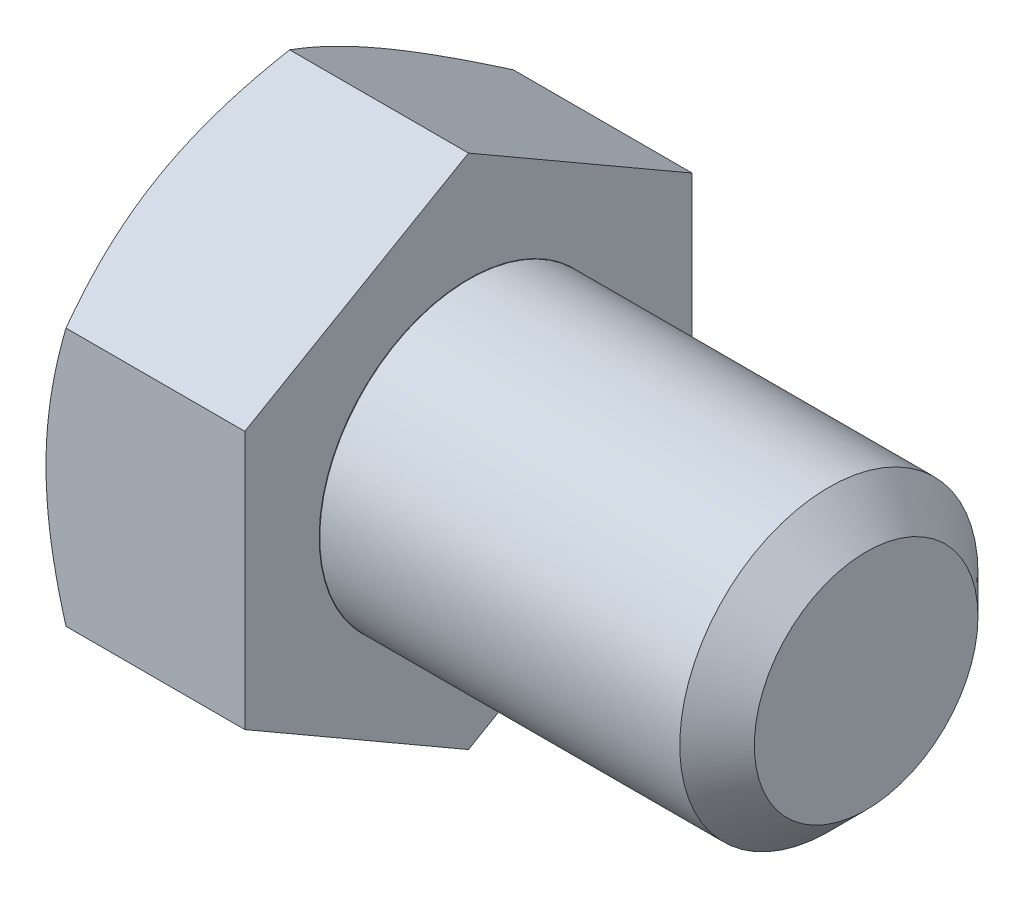
ISO-10303-21;
HEADER;
FILE_DESCRIPTION(('STEP AP214'),'2;1');
FILE_NAME('part.step','',(''),(''),'','','');
FILE_SCHEMA(('AUTOMOTIVE_DESIGN { 1 0 10303 214 1 1 1 1 }'));
ENDSEC;
DATA;
#1=APPLICATION_CONTEXT('core data for automotive mechanical design processes');
#2=APPLICATION_PROTOCOL_DEFINITION('international standard','automotive_design',2000,#1);
#3=PRODUCT_CONTEXT('',#1,'mechanical');
#4=PRODUCT('Part','Part','',(#3));
#5=PRODUCT_RELATED_PRODUCT_CATEGORY('part','',(#4));
#6=PRODUCT_DEFINITION_FORMATION('','',#4);
#7=PRODUCT_DEFINITION_CONTEXT('part definition',#1,'design');
#8=PRODUCT_DEFINITION('design','',#6,#7);
#9=PRODUCT_DEFINITION_SHAPE('','',#8);
#10=(LENGTH_UNIT() NAMED_UNIT(*) SI_UNIT(.MILLI.,.METRE.));
#11=(NAMED_UNIT(*) PLANE_ANGLE_UNIT() SI_UNIT($,.RADIAN.));
#12=(NAMED_UNIT(*) SI_UNIT($,.STERADIAN.) SOLID_ANGLE_UNIT());
#13=UNCERTAINTY_MEASURE_WITH_UNIT(LENGTH_MEASURE(1.E-05),#10,'distance_accuracy_value','');
#14=(GEOMETRIC_REPRESENTATION_CONTEXT(3) GLOBAL_UNCERTAINTY_ASSIGNED_CONTEXT((#13)) GLOBAL_UNIT_ASSIGNED_CONTEXT((#10,
#11,#12)) REPRESENTATION_CONTEXT('',''));
#15=CARTESIAN_POINT('',(0.,0.,0.));
#16=DIRECTION('',(0.,0.,1.));
#17=DIRECTION('',(1.,0.,0.));
#18=AXIS2_PLACEMENT_3D('',#15,#16,#17);
#19=CARTESIAN_POINT('',(-3.17499999999998,0.,0.));
#20=DIRECTION('',(1.,0.,0.));
#21=DIRECTION('',(0.,0.,-1.));
#22=AXIS2_PLACEMENT_3D('',#19,#20,#21);
#23=CYLINDRICAL_SURFACE('',#22,4.7625);
#24=CARTESIAN_POINT('',(8.334375,0.,0.));
#25=DIRECTION('',(1.,0.,0.));
#26=DIRECTION('',(0.,0.,-1.));
#27=AXIS2_PLACEMENT_3D('',#24,#25,#26);
#28=CIRCLE('',#27,4.7625);
#29=CARTESIAN_POINT('',(8.334375,0.,-4.7625));
#30=VERTEX_POINT('',#29);
#31=EDGE_CURVE('E12',#30,#30,#28,.F.);
#32=ORIENTED_EDGE('',*,*,#31,.T.);
#33=EDGE_LOOP('',(#32));
#34=FACE_BOUND('',#33,.T.);
#35=CARTESIAN_POINT('',(-3.16422144782449,0.,0.));
#36=DIRECTION('',(-1.,0.,0.));
#37=DIRECTION('',(0.,-1.,0.));
#38=AXIS2_PLACEMENT_3D('',#35,#36,#37);
#39=CIRCLE('',#38,4.7625);
#40=CARTESIAN_POINT('',(-3.16422144782449,-4.7625,0.));
#41=VERTEX_POINT('',#40);
#42=EDGE_CURVE('E41',#41,#41,#39,.F.);
#43=ORIENTED_EDGE('',*,*,#42,.T.);
#44=EDGE_LOOP('',(#43));
#45=FACE_BOUND('',#44,.T.);
#46=ADVANCED_FACE('F37',(#34,#45),#23,.T.);
#47=CARTESIAN_POINT('',(9.52500000000001,0.,0.));
#48=DIRECTION('',(1.,0.,0.));
#49=DIRECTION('',(0.,0.,-1.));
#50=AXIS2_PLACEMENT_3D('',#47,#48,#49);
#51=PLANE('',#50);
#52=CARTESIAN_POINT('',(9.52500000000001,0.,0.));
#53=DIRECTION('',(1.,0.,0.));
#54=DIRECTION('',(0.,0.,-1.));
#55=AXIS2_PLACEMENT_3D('',#52,#53,#54);
#56=CIRCLE('',#55,3.571875);
#57=CARTESIAN_POINT('',(9.52500000000001,0.,-3.571875));
#58=VERTEX_POINT('',#57);
#59=EDGE_CURVE('E46',#58,#58,#56,.T.);
#60=ORIENTED_EDGE('',*,*,#59,.T.);
#61=EDGE_LOOP('',(#60));
#62=FACE_BOUND('',#61,.T.);
#63=ADVANCED_FACE('F210',(#62),#51,.T.);
#64=CARTESIAN_POINT('',(9.52500000000001,0.,0.));
#65=DIRECTION('',(-1.,0.,0.));
#66=DIRECTION('',(0.,0.,1.));
#67=AXIS2_PLACEMENT_3D('',#64,#65,#66);
#68=CONICAL_SURFACE('',#67,3.571875,0.785398163397447);
#69=ORIENTED_EDGE('',*,*,#31,.F.);
#70=EDGE_LOOP('',(#69));
#71=FACE_BOUND('',#70,.T.);
#72=ORIENTED_EDGE('',*,*,#59,.F.);
#73=EDGE_LOOP('',(#72));
#74=FACE_BOUND('',#73,.T.);
#75=ADVANCED_FACE('F39',(#71,#74),#68,.T.);
#76=CARTESIAN_POINT('',(5.08467052322226,0.,0.));
#77=DIRECTION('',(-1.,0.,0.));
#78=DIRECTION('',(0.,-1.,0.));
#79=AXIS2_PLACEMENT_3D('',#76,#77,#78);
#80=CONICAL_SURFACE('',#79,0.,0.5235987755983);
#81=ORIENTED_EDGE('',*,*,#42,.F.);
#82=EDGE_LOOP('',(#81));
#83=FACE_BOUND('',#82,.T.);
#84=CARTESIAN_POINT('',(-3.17499999999998,0.,0.));
#85=DIRECTION('',(-1.,0.,0.));
#86=DIRECTION('',(0.,-1.,0.));
#87=AXIS2_PLACEMENT_3D('',#84,#85,#86);
#88=CIRCLE('',#87,4.768723);
#89=CARTESIAN_POINT('',(-3.17499999999998,-4.768723,0.));
#90=VERTEX_POINT('',#89);
#91=EDGE_CURVE('E128',#90,#90,#88,.T.);
#92=ORIENTED_EDGE('',*,*,#91,.F.);
#93=EDGE_LOOP('',(#92));
#94=FACE_BOUND('',#93,.T.);
#95=ADVANCED_FACE('F219',(#83,#94),#80,.T.);
#96=CARTESIAN_POINT('',(-9.52500000000001,-4.12444598552339,7.14375));
#97=DIRECTION('',(0.,0.,-1.));
#98=DIRECTION('',(0.,1.,0.));
#99=AXIS2_PLACEMENT_3D('',#96,#97,#98);
#100=PLANE('',#99);
#101=CARTESIAN_POINT('',(-5.93371072912466,-11.2944476437763,7.14375));
#102=CARTESIAN_POINT('',(-6.08684701816095,-10.9805232394077,7.14375000000001));
#103=CARTESIAN_POINT('',(-6.23857594161992,-10.6659008872169,7.14375000000001));
#104=CARTESIAN_POINT('',(-6.53843148642025,-10.0348898213436,7.14375000000001));
#105=CARTESIAN_POINT('',(-6.68655757920349,-9.71850085675994,7.14375000000001));
#106=CARTESIAN_POINT('',(-6.97911945790795,-9.08205743380555,7.14375000000001));
#107=CARTESIAN_POINT('',(-7.1235325502159,-8.76199250898871,7.14375000000001));
#108=CARTESIAN_POINT('',(-7.40672905657404,-8.1193909617974,7.14375000000001));
#109=CARTESIAN_POINT('',(-7.54551272309654,-7.79685445104334,7.14375000000001));
#110=CARTESIAN_POINT('',(-7.82061626761982,-7.13766604016633,7.14375000000001));
#111=CARTESIAN_POINT('',(-7.95668768509606,-6.80090989506933,7.14375000000001));
#112=CARTESIAN_POINT('',(-8.21904465695922,-6.12353919008608,7.14375000000001));
#113=CARTESIAN_POINT('',(-8.34532914408246,-5.78292421402389,7.14375));
#114=CARTESIAN_POINT('',(-8.58495433052842,-5.09786024749812,7.14375));
#115=CARTESIAN_POINT('',(-8.69831945636304,-4.75341989048741,7.14375));
#116=CARTESIAN_POINT('',(-8.90861291619239,-4.05961513378648,7.14375));
#117=CARTESIAN_POINT('',(-9.00554620334679,-3.71025225244226,7.14375));
#118=CARTESIAN_POINT('',(-9.17794726569409,-3.00829070513183,7.14375));
#119=CARTESIAN_POINT('',(-9.25353684099416,-2.65572276057783,7.14375));
#120=CARTESIAN_POINT('',(-9.34774730173221,-2.12349462014205,7.14375));
#121=CARTESIAN_POINT('',(-9.37595632988756,-1.94551103747566,7.14375));
#122=CARTESIAN_POINT('',(-9.42543567209938,-1.58858869612631,7.14375));
#123=CARTESIAN_POINT('',(-9.44670669479306,-1.40965003689206,7.14375));
#124=CARTESIAN_POINT('',(-9.48160791676572,-1.05348730697548,7.14375));
#125=CARTESIAN_POINT('',(-9.49533827490667,-0.876273093939472,7.14375));
#126=CARTESIAN_POINT('',(-9.51528471556112,-0.52142209223077,7.14375));
#127=CARTESIAN_POINT('',(-9.52150092898989,-0.343785310974307,7.14375));
#128=CARTESIAN_POINT('',(-9.5262697532719,0.0115936241285987,7.14375));
#129=CARTESIAN_POINT('',(-9.52482233137117,0.189335778422154,7.14375));
#130=CARTESIAN_POINT('',(-9.51430143505044,0.544596189800658,7.14375));
#131=CARTESIAN_POINT('',(-9.50522762080285,0.722114436555397,7.14375));
#132=CARTESIAN_POINT('',(-9.4749195257372,1.14231672690702,7.14375));
#133=CARTESIAN_POINT('',(-9.45042490108959,1.38477115845962,7.14375));
#134=CARTESIAN_POINT('',(-9.3884979515929,1.86800860977946,7.14375));
#135=CARTESIAN_POINT('',(-9.3510640485552,2.10879142200519,7.14375));
#136=CARTESIAN_POINT('',(-9.22132806473631,2.82827840353934,7.14375));
#137=CARTESIAN_POINT('',(-9.11161060877735,3.30389106689052,7.14375));
#138=CARTESIAN_POINT('',(-8.91968369997709,4.01550298491581,7.14375));
#139=CARTESIAN_POINT('',(-8.85018765803782,4.2551445486297,7.14375));
#140=CARTESIAN_POINT('',(-8.70356361255966,4.73210450573967,7.14375));
#141=CARTESIAN_POINT('',(-8.62643554863459,4.96942288073787,7.14375));
#142=CARTESIAN_POINT('',(-8.46581893944217,5.4418061469649,7.14375));
#143=CARTESIAN_POINT('',(-8.38233210608425,5.67687162566703,7.14375));
#144=CARTESIAN_POINT('',(-8.21002141112747,6.14502503891484,7.14375));
#145=CARTESIAN_POINT('',(-8.12119768188874,6.37811302234081,7.14375));
#146=CARTESIAN_POINT('',(-7.87094818930498,7.01633974983141,7.14375));
#147=CARTESIAN_POINT('',(-7.70494014176838,7.41968025406995,7.14375));
#148=CARTESIAN_POINT('',(-7.36287467668176,8.22209357946086,7.14375));
#149=CARTESIAN_POINT('',(-7.18681604954135,8.62116588004215,7.14375));
#150=CARTESIAN_POINT('',(-6.82707563050151,9.41604681837601,7.14375));
#151=CARTESIAN_POINT('',(-6.64339071307001,9.81185403670851,7.14375));
#152=CARTESIAN_POINT('',(-6.27025973065678,10.600712317216,7.14375));
#153=CARTESIAN_POINT('',(-6.08081392218425,10.9937635011499,7.14375));
#154=CARTESIAN_POINT('',(-5.6971131080566,11.7783335003943,7.14375));
#155=CARTESIAN_POINT('',(-5.50285048567349,12.1698485826142,7.14375));
#156=CARTESIAN_POINT('',(-5.11077276765251,12.9510972653694,7.14375));
#157=CARTESIAN_POINT('',(-4.91295763958178,13.3408308495995,7.14375));
#158=CARTESIAN_POINT('',(-4.51453178773117,14.1187472681695,7.14375));
#159=CARTESIAN_POINT('',(-4.31392174218005,14.5069304503015,7.14375));
#160=CARTESIAN_POINT('',(-3.91039131968376,15.2820948012496,7.14375));
#161=CARTESIAN_POINT('',(-3.70747093338289,15.6690759651901,7.14375));
#162=CARTESIAN_POINT('',(-3.14034733034596,16.7442233759679,7.14375));
#163=CARTESIAN_POINT('',(-2.77409176308878,17.4313067825052,7.14375));
#164=CARTESIAN_POINT('',(-2.03723567347499,18.8031936251545,7.14375));
#165=CARTESIAN_POINT('',(-1.66663486270932,19.4879969060088,7.14375));
#166=CARTESIAN_POINT('',(-0.92352014301375,20.8534506388627,7.14375));
#167=CARTESIAN_POINT('',(-0.551017506612391,21.5341072316457,7.14375));
#168=CARTESIAN_POINT('',(0.196444878969431,22.8939962458748,7.14374999999999));
#169=CARTESIAN_POINT('',(0.571404419683328,23.5732287818577,7.14374999999999));
#170=CARTESIAN_POINT('',(0.947254101476003,24.2519647910624,7.14374999999999));
#171=B_SPLINE_CURVE_WITH_KNOTS('',3,(#101,#102,#103,#104,#105,#106,#107,#108,#109,#110,#111,
#112,#113,#114,#115,#116,#117,#118,#119,#120,#121,#122,#123,#124,#125,#126,#127,#128,#129,#130,
#131,#132,#133,#134,#135,#136,#137,#138,#139,#140,#141,#142,#143,#144,#145,#146,#147,#148,#149,
#150,#151,#152,#153,#154,#155,#156,#157,#158,#159,#160,#161,#162,#163,#164,#165,#166,#167,#168,
#169,#170),.UNSPECIFIED.,.F.,.F.,(4,2,2,2,2,2,2,2,2,2,2,2,2,2,2,2,2,2,2,2,2,2,2,2,2,2,2,2,2,2,2,
2,2,2,4),(0.,1.04786354483491,2.0958799018221,3.14924522983534,4.20256326345294,5.2920693919564,
6.38169416429138,7.46922336086985,8.55642415101154,9.63728918942531,10.1777908946976,
10.7182373766564,11.2513201674657,11.7843936705003,12.3174694518642,12.8505689880335,
13.5812265935341,14.3119733479507,15.7741561909275,16.522632821703,17.2711153750576,
18.0193971292228,18.7676603329377,20.0759569450815,21.384411344443,22.6934073945101,
24.002345245369,25.3135047056319,26.6246761423151,27.9355347616116,29.2463986911018,
31.5821913644605,33.9181399602315,36.2458936638359,38.573452352829),.UNSPECIFIED.);
#172=CARTESIAN_POINT('',(-8.88694598552339,-4.12444598552339,7.14375));
#173=VERTEX_POINT('',#172);
#174=CARTESIAN_POINT('',(-9.52500000000001,0.,7.14375));
#175=VERTEX_POINT('',#174);
#176=EDGE_CURVE('E228',#173,#175,#171,.T.);
#177=ORIENTED_EDGE('',*,*,#176,.F.);
#178=DIRECTION('',(1.,0.,0.));
#179=VECTOR('',#178,1.);
#180=CARTESIAN_POINT('',(-9.52500000000001,-4.12444598552339,7.14375));
#181=LINE('',#180,#179);
#182=CARTESIAN_POINT('',(-3.17499999999998,-4.12444598552339,7.14375));
#183=VERTEX_POINT('',#182);
#184=EDGE_CURVE('E231',#173,#183,#181,.T.);
#185=ORIENTED_EDGE('',*,*,#184,.T.);
#186=DIRECTION('',(0.,1.,0.));
#187=VECTOR('',#186,1.);
#188=CARTESIAN_POINT('',(-3.17499999999998,-4.12444598552339,7.14375));
#189=LINE('',#188,#187);
#190=CARTESIAN_POINT('',(-3.17499999999998,4.12444598552339,7.14375));
#191=VERTEX_POINT('',#190);
#192=EDGE_CURVE('E233',#183,#191,#189,.T.);
#193=ORIENTED_EDGE('',*,*,#192,.T.);
#194=DIRECTION('',(1.,0.,0.));
#195=VECTOR('',#194,1.);
#196=CARTESIAN_POINT('',(-9.52500000000001,4.12444598552339,7.14375));
#197=LINE('',#196,#195);
#198=CARTESIAN_POINT('',(-8.88694598552339,4.12444598552339,7.14375));
#199=VERTEX_POINT('',#198);
#200=EDGE_CURVE('E253',#199,#191,#197,.T.);
#201=ORIENTED_EDGE('',*,*,#200,.F.);
#202=EDGE_CURVE('E113',#175,#199,#171,.T.);
#203=ORIENTED_EDGE('',*,*,#202,.F.);
#204=EDGE_LOOP('',(#177,#185,#193,#201,#203));
#205=FACE_BOUND('',#204,.T.);
#206=ADVANCED_FACE('F208',(#205),#100,.F.);
#207=CARTESIAN_POINT('',(-9.52500000000001,4.12444598552339,7.14375));
#208=DIRECTION('',(0.,-0.866025403784439,-0.5));
#209=DIRECTION('',(0.,0.5,-0.866025403784439));
#210=AXIS2_PLACEMENT_3D('',#207,#208,#209);
#211=PLANE('',#210);
#212=CARTESIAN_POINT('',(-8.88687931745691,4.12433051546955,7.14395));
#213=CARTESIAN_POINT('',(-8.93921396854997,4.21499047493765,6.98692234398911));
#214=CARTESIAN_POINT('',(-8.98917347414078,4.30598845856222,6.82930921296504));
#215=CARTESIAN_POINT('',(-9.08368803246841,4.48872342670424,6.51280296382358));
#216=CARTESIAN_POINT('',(-9.12824075379794,4.58046071195489,6.35390932482102));
#217=CARTESIAN_POINT('',(-9.25291423788883,4.85714139103217,5.87468433118651));
#218=CARTESIAN_POINT('',(-9.32382709004425,5.04317693592539,5.55246131541769));
#219=CARTESIAN_POINT('',(-9.40698076140307,5.32157574305278,5.07026043670648));
#220=CARTESIAN_POINT('',(-9.43066883444349,5.4131071832703,4.91172333175978));
#221=CARTESIAN_POINT('',(-9.47039027686449,5.59658364372469,4.59393278025988));
#222=CARTESIAN_POINT('',(-9.48642432257556,5.6885286266948,4.4346793982546));
#223=CARTESIAN_POINT('',(-9.51042907799102,5.87257827929426,4.11589604883692));
#224=CARTESIAN_POINT('',(-9.5184089385863,5.96468264833057,3.95636660206697));
#225=CARTESIAN_POINT('',(-9.52614277570776,6.14897138013525,3.63716915531883));
#226=CARTESIAN_POINT('',(-9.52589700635726,6.24115574034438,3.47750115977338));
#227=CARTESIAN_POINT('',(-9.51391708960882,6.49371006632156,3.04006423550959));
#228=CARTESIAN_POINT('',(-9.49380637885497,6.65399735752975,2.76243850332943));
#229=CARTESIAN_POINT('',(-9.43003549325701,6.97350732659354,2.20903100338617));
#230=CARTESIAN_POINT('',(-9.38635352253424,7.13272888080875,1.93325118182535));
#231=CARTESIAN_POINT('',(-9.27716140954326,7.45288184700058,1.37872997818721));
#232=CARTESIAN_POINT('',(-9.21118863811183,7.61377286233254,1.10005856515092));
#233=CARTESIAN_POINT('',(-9.06145711784187,7.93315557291966,0.546871483354954));
#234=CARTESIAN_POINT('',(-8.97773353962436,8.09165135831551,0.272348730263809));
#235=CARTESIAN_POINT('',(-8.88687931745691,8.24900744110062,-0.000199999999998812));
#236=B_SPLINE_CURVE_WITH_KNOTS('',3,(#212,#213,#214,#215,#216,#217,#218,#219,#220,#221,#222,
#223,#224,#225,#226,#227,#228,#229,#230,#231,#232,#233,#234,#235),.UNSPECIFIED.,.F.,.F.,(4,2,2,
2,2,2,2,2,2,2,2,4),(0.,0.566119481838006,1.13248221371019,2.2675610579816,2.82119915823018,
3.37478832846408,3.92774781910558,4.48069022658465,5.44329448766885,6.4067903790172,
7.39165514483024,8.37458648302854),.UNSPECIFIED.);
#237=CARTESIAN_POINT('',(-9.52500000000001,6.18666897828508,3.571875));
#238=VERTEX_POINT('',#237);
#239=EDGE_CURVE('E109',#199,#238,#236,.T.);
#240=ORIENTED_EDGE('',*,*,#239,.F.);
#241=ORIENTED_EDGE('',*,*,#200,.T.);
#242=DIRECTION('',(0.,0.5,-0.866025403784439));
#243=VECTOR('',#242,1.);
#244=CARTESIAN_POINT('',(-3.17499999999998,4.12444598552339,7.14375));
#245=LINE('',#244,#243);
#246=CARTESIAN_POINT('',(-3.17499999999998,8.24889197104678,0.));
#247=VERTEX_POINT('',#246);
#248=EDGE_CURVE('E269',#191,#247,#245,.T.);
#249=ORIENTED_EDGE('',*,*,#248,.T.);
#250=DIRECTION('',(1.,0.,0.));
#251=VECTOR('',#250,1.);
#252=CARTESIAN_POINT('',(-9.52500000000001,8.24889197104678,0.));
#253=LINE('',#252,#251);
#254=CARTESIAN_POINT('',(-8.88694598552339,8.24889197104678,0.));
#255=VERTEX_POINT('',#254);
#256=EDGE_CURVE('E138',#255,#247,#253,.T.);
#257=ORIENTED_EDGE('',*,*,#256,.F.);
#258=EDGE_CURVE('E117',#238,#255,#236,.T.);
#259=ORIENTED_EDGE('',*,*,#258,.F.);
#260=EDGE_LOOP('',(#240,#241,#249,#257,#259));
#261=FACE_BOUND('',#260,.T.);
#262=ADVANCED_FACE('F136',(#261),#211,.F.);
#263=CARTESIAN_POINT('',(-9.52500000000001,8.24889197104678,0.));
#264=DIRECTION('',(0.,-0.866025403784439,0.5));
#265=DIRECTION('',(0.,-0.5,-0.866025403784439));
#266=AXIS2_PLACEMENT_3D('',#263,#264,#265);
#267=PLANE('',#266);
#268=CARTESIAN_POINT('',(-8.88687931745691,8.24900744110062,0.000199999999998812));
#269=CARTESIAN_POINT('',(-8.93921396854997,8.15834748163251,-0.156827656010891));
#270=CARTESIAN_POINT('',(-8.98917347414078,8.06734949800795,-0.314440787034963));
#271=CARTESIAN_POINT('',(-9.08368803246841,7.88461452986593,-0.630947036176422));
#272=CARTESIAN_POINT('',(-9.12824075379794,7.79287724461528,-0.78984067517898));
#273=CARTESIAN_POINT('',(-9.25291423788883,7.516196565538,-1.26906566881349));
#274=CARTESIAN_POINT('',(-9.32382709004426,7.33016102064478,-1.59128868458231));
#275=CARTESIAN_POINT('',(-9.40698076140307,7.05176221351739,-2.07348956329352));
#276=CARTESIAN_POINT('',(-9.43066883444349,6.96023077329986,-2.23202666824022));
#277=CARTESIAN_POINT('',(-9.47039027686449,6.77675431284548,-2.54981721974012));
#278=CARTESIAN_POINT('',(-9.48642432257555,6.68480932987537,-2.7090706017454));
#279=CARTESIAN_POINT('',(-9.51042907799102,6.50075967727591,-3.02785395116307));
#280=CARTESIAN_POINT('',(-9.5184089385863,6.4086553082396,-3.18738339793303));
#281=CARTESIAN_POINT('',(-9.52614277570776,6.22436657643492,-3.50658084468117));
#282=CARTESIAN_POINT('',(-9.52589700635726,6.13218221622578,-3.66624884022662));
#283=CARTESIAN_POINT('',(-9.51391708960882,5.8796278902486,-4.1036857644904));
#284=CARTESIAN_POINT('',(-9.49380637885496,5.71934059904042,-4.38131149667057));
#285=CARTESIAN_POINT('',(-9.43003549325701,5.39983062997663,-4.93471899661383));
#286=CARTESIAN_POINT('',(-9.38635352253424,5.24060907576142,-5.21049881817465));
#287=CARTESIAN_POINT('',(-9.27716140954326,4.92045610956958,-5.76502002181279));
#288=CARTESIAN_POINT('',(-9.21118863811183,4.75956509423763,-6.04369143484908));
#289=CARTESIAN_POINT('',(-9.06145711784187,4.4401823836505,-6.59687851664504));
#290=CARTESIAN_POINT('',(-8.97773353962436,4.28168659825466,-6.87140126973619));
#291=CARTESIAN_POINT('',(-8.88687931745691,4.12433051546955,-7.14395));
#292=B_SPLINE_CURVE_WITH_KNOTS('',3,(#268,#269,#270,#271,#272,#273,#274,#275,#276,#277,#278,
#279,#280,#281,#282,#283,#284,#285,#286,#287,#288,#289,#290,#291),.UNSPECIFIED.,.F.,.F.,(4,2,2,
2,2,2,2,2,2,2,2,4),(0.,0.566119481838007,1.1324822137102,2.2675610579816,2.82119915823018,
3.37478832846408,3.92774781910558,4.48069022658465,5.44329448766885,6.4067903790172,
7.39165514483024,8.37458648302854),.UNSPECIFIED.);
#293=CARTESIAN_POINT('',(-9.52500000000001,6.18666897828508,-3.571875));
#294=VERTEX_POINT('',#293);
#295=EDGE_CURVE('E124',#255,#294,#292,.T.);
#296=ORIENTED_EDGE('',*,*,#295,.F.);
#297=ORIENTED_EDGE('',*,*,#256,.T.);
#298=DIRECTION('',(0.,-0.5,-0.866025403784439));
#299=VECTOR('',#298,1.);
#300=CARTESIAN_POINT('',(-3.17499999999998,8.24889197104678,0.));
#301=LINE('',#300,#299);
#302=CARTESIAN_POINT('',(-3.17499999999998,4.12444598552339,-7.14375));
#303=VERTEX_POINT('',#302);
#304=EDGE_CURVE('E270',#247,#303,#301,.T.);
#305=ORIENTED_EDGE('',*,*,#304,.T.);
#306=DIRECTION('',(1.,0.,0.));
#307=VECTOR('',#306,1.);
#308=CARTESIAN_POINT('',(-9.52500000000001,4.12444598552339,-7.14375));
#309=LINE('',#308,#307);
#310=CARTESIAN_POINT('',(-8.88694598552339,4.12444598552339,-7.14375));
#311=VERTEX_POINT('',#310);
#312=EDGE_CURVE('E250',#311,#303,#309,.T.);
#313=ORIENTED_EDGE('',*,*,#312,.F.);
#314=EDGE_CURVE('E139',#294,#311,#292,.T.);
#315=ORIENTED_EDGE('',*,*,#314,.F.);
#316=EDGE_LOOP('',(#296,#297,#305,#313,#315));
#317=FACE_BOUND('',#316,.T.);
#318=ADVANCED_FACE('F199',(#317),#267,.F.);
#319=CARTESIAN_POINT('',(-9.52500000000001,4.12444598552339,-7.14375));
#320=DIRECTION('',(0.,0.,1.));
#321=DIRECTION('',(0.,-1.,0.));
#322=AXIS2_PLACEMENT_3D('',#319,#320,#321);
#323=PLANE('',#322);
#324=CARTESIAN_POINT('',(-5.93371073514098,-11.2944476314463,-7.14375));
#325=CARTESIAN_POINT('',(-6.08684702392691,-10.980523227493,-7.14375));
#326=CARTESIAN_POINT('',(-6.23857594713566,-10.6659008757179,-7.14375));
#327=CARTESIAN_POINT('',(-6.53843149143677,-10.0348898106771,-7.14375));
#328=CARTESIAN_POINT('',(-6.686557583971,-9.7185008465103,-7.14375));
#329=CARTESIAN_POINT('',(-6.97911946217735,-9.08205742439586,-7.14375));
#330=CARTESIAN_POINT('',(-7.12353255423625,-8.7619925000021,-7.14375));
#331=CARTESIAN_POINT('',(-7.40672906010034,-8.11939095365977,-7.14375));
#332=CARTESIAN_POINT('',(-7.54551272637785,-7.79685444333161,-7.14375));
#333=CARTESIAN_POINT('',(-7.82061627040319,-7.13766603334092,-7.14375));
#334=CARTESIAN_POINT('',(-7.95668768762707,-6.80090988870464,-7.14375));
#335=CARTESIAN_POINT('',(-8.21904465899876,-6.12353918465013,-7.14375));
#336=CARTESIAN_POINT('',(-8.34532914588289,-5.78292420905595,-7.14375));
#337=CARTESIAN_POINT('',(-8.5849543318731,-5.09786024347485,-7.14375));
#338=CARTESIAN_POINT('',(-8.69831945749102,-4.75341988694076,-7.14375));
#339=CARTESIAN_POINT('',(-8.90861291692163,-4.05961513120584,-7.14375));
#340=CARTESIAN_POINT('',(-9.00554620389399,-3.71025225035102,-7.14375));
#341=CARTESIAN_POINT('',(-9.17794726587328,-3.00829070426652,-7.14375));
#342=CARTESIAN_POINT('',(-9.25353684100095,-2.65572276045245,-7.14375));
#343=CARTESIAN_POINT('',(-9.34774730156327,-2.12349462113998,-7.14375));
#344=CARTESIAN_POINT('',(-9.37595632967388,-1.94551103885013,-7.14375));
#345=CARTESIAN_POINT('',(-9.4254356718271,-1.5885886982572,-7.14375));
#346=CARTESIAN_POINT('',(-9.44670669450692,-1.40965003940283,-7.14375));
#347=CARTESIAN_POINT('',(-9.48160791648557,-1.05348731023808,-7.14375));
#348=CARTESIAN_POINT('',(-9.49533827464573,-0.87627309757399,-7.14375));
#349=CARTESIAN_POINT('',(-9.51528471537167,-0.521422096608592,-7.14375));
#350=CARTESIAN_POINT('',(-9.5215009288527,-0.343785315723515,-7.14375));
#351=CARTESIAN_POINT('',(-9.52626975327169,0.0115936186392625,-7.14375));
#352=CARTESIAN_POINT('',(-9.52482233145568,0.189335772564074,-7.14375));
#353=CARTESIAN_POINT('',(-9.51430143533466,0.544596183209794,-7.14375));
#354=CARTESIAN_POINT('',(-9.50522762120205,0.722114429600492,-7.14375));
#355=CARTESIAN_POINT('',(-9.47491952641903,1.14231671939732,-7.14375));
#356=CARTESIAN_POINT('',(-9.45042490193357,1.3847711507607,-7.14375));
#357=CARTESIAN_POINT('',(-9.38849795276973,1.8680086017109,-7.14375));
#358=CARTESIAN_POINT('',(-9.35106404990273,2.1087914137562,-7.14375));
#359=CARTESIAN_POINT('',(-9.22132806659936,2.8282783947592,-7.14375));
#360=CARTESIAN_POINT('',(-9.11161061098841,3.30389105777069,-7.14375));
#361=CARTESIAN_POINT('',(-8.91968370270124,4.015502975288,-7.14375));
#362=CARTESIAN_POINT('',(-8.85018766093416,4.25514453882878,-7.14375));
#363=CARTESIAN_POINT('',(-8.7035636157949,4.7321044955946,-7.14375));
#364=CARTESIAN_POINT('',(-8.62643555203655,4.96942287042174,-7.14375));
#365=CARTESIAN_POINT('',(-8.46581894317135,5.44180613630802,-7.14375));
#366=CARTESIAN_POINT('',(-8.38233210997393,5.67687161484044,-7.14375));
#367=CARTESIAN_POINT('',(-8.21002141533235,6.14502502774882,-7.14375));
#368=CARTESIAN_POINT('',(-8.12119768624832,6.37811301100508,-7.14375));
#369=CARTESIAN_POINT('',(-7.87094819393523,7.01633973840397,-7.14375));
#370=CARTESIAN_POINT('',(-7.70494014649651,7.41968024271512,-7.14375));
#371=CARTESIAN_POINT('',(-7.36287468157655,8.22209356824176,-7.14375));
#372=CARTESIAN_POINT('',(-7.18681605450491,8.62116586888614,-7.14375000000001));
#373=CARTESIAN_POINT('',(-6.82707563558166,9.41604680733946,-7.14375000000001));
#374=CARTESIAN_POINT('',(-6.64339071819795,9.8118540257283,-7.14375000000001));
#375=CARTESIAN_POINT('',(-6.27025973586567,10.6007123063424,-7.14375000000001));
#376=CARTESIAN_POINT('',(-6.0808139274263,10.9937634903265,-7.14375000000001));
#377=CARTESIAN_POINT('',(-5.69711311335276,11.7783334896699,-7.14375000000001));
#378=CARTESIAN_POINT('',(-5.50285049099054,12.1698485719387,-7.14375000000001));
#379=CARTESIAN_POINT('',(-5.1107727730034,12.951097254788,-7.14375000000001));
#380=CARTESIAN_POINT('',(-4.91295764494562,13.3408308390634,-7.14375000000001));
#381=CARTESIAN_POINT('',(-4.51453179311523,14.1187472577206,-7.14375000000001));
#382=CARTESIAN_POINT('',(-4.31392174757139,14.5069304398944,-7.14375000000001));
#383=CARTESIAN_POINT('',(-3.91039132508514,15.2820947909242,-7.14375000000001));
#384=CARTESIAN_POINT('',(-3.70747093878702,15.6690759549044,-7.14375000000001));
#385=CARTESIAN_POINT('',(-3.1403473357884,16.744223365723,-7.14375000000001));
#386=CARTESIAN_POINT('',(-2.77409176856359,17.4313067722598,-7.14375000000001));
#387=CARTESIAN_POINT('',(-2.03723567900798,18.8031936149052,-7.14375000000001));
#388=CARTESIAN_POINT('',(-1.66663486826812,19.487996895756,-7.14375000000001));
#389=CARTESIAN_POINT('',(-0.923520148626056,20.853450628589,-7.14375000000001));
#390=CARTESIAN_POINT('',(-0.551017512252464,21.5341072213546,-7.14375000000001));
#391=CARTESIAN_POINT('',(0.196444873276726,22.8939962355469,-7.14375000000001));
#392=CARTESIAN_POINT('',(0.571404413965756,23.5732287715106,-7.14375000000001));
#393=CARTESIAN_POINT('',(0.947254095734512,24.2519647806954,-7.14375));
#394=B_SPLINE_CURVE_WITH_KNOTS('',3,(#324,#325,#326,#327,#328,#329,#330,#331,#332,#333,#334,
#335,#336,#337,#338,#339,#340,#341,#342,#343,#344,#345,#346,#347,#348,#349,#350,#351,#352,#353,
#354,#355,#356,#357,#358,#359,#360,#361,#362,#363,#364,#365,#366,#367,#368,#369,#370,#371,#372,
#373,#374,#375,#376,#377,#378,#379,#380,#381,#382,#383,#384,#385,#386,#387,#388,#389,#390,#391,
#392,#393),.UNSPECIFIED.,.F.,.F.,(4,2,2,2,2,2,2,2,2,2,2,2,2,2,2,2,2,2,2,2,2,2,2,2,2,2,2,2,2,2,2,
2,2,2,4),(0.,1.04786354338569,2.09587989892346,3.14924522547247,4.20256325762595,
5.2920693845644,6.38169415533385,7.46922335035171,8.55642413893401,9.63728917507435,
10.1777908792107,10.7182373600339,11.2513201497363,11.784393651664,12.3174694319207,
12.8505689669825,13.5812265718698,14.3119733256731,15.7741561674203,16.5226327975529,
17.2711153502647,18.0193971037888,18.7676603068625,20.0759569190947,21.3844113185457,
22.6934073687054,24.0023452196567,25.3135046800229,26.6246761168095,27.9355347362076,
29.2463986657994,31.5821913391112,33.9181399348361,36.2458936383548,38.573452327261),.UNSPECIFIED.);
#395=CARTESIAN_POINT('',(-9.52500000000001,0.,-7.14375));
#396=VERTEX_POINT('',#395);
#397=EDGE_CURVE('E193',#311,#396,#394,.F.);
#398=ORIENTED_EDGE('',*,*,#397,.F.);
#399=ORIENTED_EDGE('',*,*,#312,.T.);
#400=DIRECTION('',(0.,-1.,0.));
#401=VECTOR('',#400,1.);
#402=CARTESIAN_POINT('',(-3.17499999999998,4.12444598552339,-7.14375));
#403=LINE('',#402,#401);
#404=CARTESIAN_POINT('',(-3.17499999999998,-4.12444598552339,-7.14375));
#405=VERTEX_POINT('',#404);
#406=EDGE_CURVE('E275',#303,#405,#403,.T.);
#407=ORIENTED_EDGE('',*,*,#406,.T.);
#408=DIRECTION('',(1.,0.,0.));
#409=VECTOR('',#408,1.);
#410=CARTESIAN_POINT('',(-9.52500000000001,-4.12444598552339,-7.14375));
#411=LINE('',#410,#409);
#412=CARTESIAN_POINT('',(-8.88694598552339,-4.12444598552339,-7.14375));
#413=VERTEX_POINT('',#412);
#414=EDGE_CURVE('E243',#413,#405,#411,.T.);
#415=ORIENTED_EDGE('',*,*,#414,.F.);
#416=EDGE_CURVE('E187',#396,#413,#394,.F.);
#417=ORIENTED_EDGE('',*,*,#416,.F.);
#418=EDGE_LOOP('',(#398,#399,#407,#415,#417));
#419=FACE_BOUND('',#418,.T.);
#420=ADVANCED_FACE('F195',(#419),#323,.F.);
#421=CARTESIAN_POINT('',(-9.52500000000001,-4.12444598552339,-7.14375));
#422=DIRECTION('',(0.,0.866025403784439,0.5));
#423=DIRECTION('',(0.,-0.5,0.866025403784439));
#424=AXIS2_PLACEMENT_3D('',#421,#422,#423);
#425=PLANE('',#424);
#426=CARTESIAN_POINT('',(-8.88687931745691,-4.12433051546955,-7.14395));
#427=CARTESIAN_POINT('',(-8.93921396854997,-4.21499047493766,-6.98692234398911));
#428=CARTESIAN_POINT('',(-8.98917347414078,-4.30598845856223,-6.82930921296504));
#429=CARTESIAN_POINT('',(-9.08368803246841,-4.48872342670425,-6.51280296382358));
#430=CARTESIAN_POINT('',(-9.12824075379794,-4.58046071195489,-6.35390932482102));
#431=CARTESIAN_POINT('',(-9.25291423788883,-4.85714139103218,-5.87468433118651));
#432=CARTESIAN_POINT('',(-9.32382709004426,-5.04317693592539,-5.55246131541769));
#433=CARTESIAN_POINT('',(-9.40698076140307,-5.32157574305279,-5.07026043670648));
#434=CARTESIAN_POINT('',(-9.43066883444349,-5.41310718327031,-4.91172333175978));
#435=CARTESIAN_POINT('',(-9.47039027686449,-5.59658364372469,-4.59393278025988));
#436=CARTESIAN_POINT('',(-9.48642432257555,-5.6885286266948,-4.43467939825459));
#437=CARTESIAN_POINT('',(-9.51042907799102,-5.87257827929427,-4.11589604883692));
#438=CARTESIAN_POINT('',(-9.5184089385863,-5.96468264833057,-3.95636660206697));
#439=CARTESIAN_POINT('',(-9.52614277570776,-6.14897138013525,-3.63716915531882));
#440=CARTESIAN_POINT('',(-9.52589700635726,-6.24115574034439,-3.47750115977337));
#441=CARTESIAN_POINT('',(-9.51391708960882,-6.49371006632156,-3.04006423550959));
#442=CARTESIAN_POINT('',(-9.49380637885496,-6.65399735752975,-2.76243850332942));
#443=CARTESIAN_POINT('',(-9.43003549325701,-6.97350732659355,-2.20903100338617));
#444=CARTESIAN_POINT('',(-9.38635352253424,-7.13272888080875,-1.93325118182535));
#445=CARTESIAN_POINT('',(-9.27716140954326,-7.45288184700059,-1.37872997818721));
#446=CARTESIAN_POINT('',(-9.21118863811183,-7.61377286233255,-1.10005856515092));
#447=CARTESIAN_POINT('',(-9.06145711784187,-7.93315557291967,-0.546871483354955));
#448=CARTESIAN_POINT('',(-8.97773353962436,-8.09165135831552,-0.272348730263811));
#449=CARTESIAN_POINT('',(-8.88687931745691,-8.24900744110062,0.000199999999998812));
#450=B_SPLINE_CURVE_WITH_KNOTS('',3,(#426,#427,#428,#429,#430,#431,#432,#433,#434,#435,#436,
#437,#438,#439,#440,#441,#442,#443,#444,#445,#446,#447,#448,#449),.UNSPECIFIED.,.F.,.F.,(4,2,2,
2,2,2,2,2,2,2,2,4),(0.,0.566119481838008,1.1324822137102,2.26756105798161,2.82119915823018,
3.37478832846408,3.92774781910559,4.48069022658465,5.44329448766885,6.4067903790172,
7.39165514483024,8.37458648302854),.UNSPECIFIED.);
#451=CARTESIAN_POINT('',(-9.52500000000001,-6.18666897828508,-3.571875));
#452=VERTEX_POINT('',#451);
#453=EDGE_CURVE('E194',#413,#452,#450,.T.);
#454=ORIENTED_EDGE('',*,*,#453,.F.);
#455=ORIENTED_EDGE('',*,*,#414,.T.);
#456=DIRECTION('',(0.,-0.5,0.866025403784439));
#457=VECTOR('',#456,1.);
#458=CARTESIAN_POINT('',(-3.17499999999998,-4.12444598552339,-7.14375));
#459=LINE('',#458,#457);
#460=CARTESIAN_POINT('',(-3.17499999999998,-8.24889197104678,0.));
#461=VERTEX_POINT('',#460);
#462=EDGE_CURVE('E245',#405,#461,#459,.T.);
#463=ORIENTED_EDGE('',*,*,#462,.T.);
#464=DIRECTION('',(1.,0.,0.));
#465=VECTOR('',#464,1.);
#466=CARTESIAN_POINT('',(-9.52500000000001,-8.24889197104678,0.));
#467=LINE('',#466,#465);
#468=CARTESIAN_POINT('',(-8.88694598552339,-8.24889197104678,0.));
#469=VERTEX_POINT('',#468);
#470=EDGE_CURVE('E241',#469,#461,#467,.T.);
#471=ORIENTED_EDGE('',*,*,#470,.F.);
#472=EDGE_CURVE('E181',#452,#469,#450,.T.);
#473=ORIENTED_EDGE('',*,*,#472,.F.);
#474=EDGE_LOOP('',(#454,#455,#463,#471,#473));
#475=FACE_BOUND('',#474,.T.);
#476=ADVANCED_FACE('F198',(#475),#425,.F.);
#477=CARTESIAN_POINT('',(-9.52500000000001,-8.24889197104678,0.));
#478=DIRECTION('',(0.,0.866025403784439,-0.5));
#479=DIRECTION('',(0.,0.5,0.866025403784439));
#480=AXIS2_PLACEMENT_3D('',#477,#478,#479);
#481=PLANE('',#480);
#482=CARTESIAN_POINT('',(-8.88687931745691,-8.24900744110062,-0.000199999999998812));
#483=CARTESIAN_POINT('',(-8.93921396854997,-8.15834748163251,0.156827656010891));
#484=CARTESIAN_POINT('',(-8.98917347414078,-8.06734949800795,0.314440787034963));
#485=CARTESIAN_POINT('',(-9.08368803246841,-7.88461452986593,0.630947036176422));
#486=CARTESIAN_POINT('',(-9.12824075379794,-7.79287724461528,0.789840675178981));
#487=CARTESIAN_POINT('',(-9.25291423788883,-7.516196565538,1.26906566881349));
#488=CARTESIAN_POINT('',(-9.32382709004426,-7.33016102064478,1.59128868458231));
#489=CARTESIAN_POINT('',(-9.40698076140307,-7.05176221351739,2.07348956329352));
#490=CARTESIAN_POINT('',(-9.43066883444349,-6.96023077329986,2.23202666824022));
#491=CARTESIAN_POINT('',(-9.47039027686449,-6.77675431284548,2.54981721974012));
#492=CARTESIAN_POINT('',(-9.48642432257555,-6.68480932987537,2.70907060174541));
#493=CARTESIAN_POINT('',(-9.51042907799102,-6.5007596772759,3.02785395116308));
#494=CARTESIAN_POINT('',(-9.5184089385863,-6.4086553082396,3.18738339793303));
#495=CARTESIAN_POINT('',(-9.52614277570776,-6.22436657643492,3.50658084468117));
#496=CARTESIAN_POINT('',(-9.52589700635726,-6.13218221622578,3.66624884022663));
#497=CARTESIAN_POINT('',(-9.51391708960882,-5.87962789024861,4.10368576449041));
#498=CARTESIAN_POINT('',(-9.49380637885496,-5.71934059904042,4.38131149667058));
#499=CARTESIAN_POINT('',(-9.43003549325701,-5.39983062997662,4.93471899661383));
#500=CARTESIAN_POINT('',(-9.38635352253424,-5.24060907576142,5.21049881817465));
#501=CARTESIAN_POINT('',(-9.27716140954326,-4.92045610956958,5.76502002181279));
#502=CARTESIAN_POINT('',(-9.21118863811183,-4.75956509423762,6.04369143484909));
#503=CARTESIAN_POINT('',(-9.06145711784187,-4.4401823836505,6.59687851664505));
#504=CARTESIAN_POINT('',(-8.97773353962436,-4.28168659825465,6.87140126973619));
#505=CARTESIAN_POINT('',(-8.88687931745691,-4.12433051546955,7.14395));
#506=B_SPLINE_CURVE_WITH_KNOTS('',3,(#482,#483,#484,#485,#486,#487,#488,#489,#490,#491,#492,
#493,#494,#495,#496,#497,#498,#499,#500,#501,#502,#503,#504,#505),.UNSPECIFIED.,.F.,.F.,(4,2,2,
2,2,2,2,2,2,2,2,4),(0.,0.566119481838007,1.1324822137102,2.26756105798161,2.82119915823018,
3.37478832846408,3.92774781910559,4.48069022658465,5.44329448766885,6.40679037901721,
7.39165514483024,8.37458648302855),.UNSPECIFIED.);
#507=CARTESIAN_POINT('',(-9.52500000000001,-6.18666897828509,3.571875));
#508=VERTEX_POINT('',#507);
#509=EDGE_CURVE('E295',#469,#508,#506,.T.);
#510=ORIENTED_EDGE('',*,*,#509,.F.);
#511=ORIENTED_EDGE('',*,*,#470,.T.);
#512=DIRECTION('',(0.,0.5,0.866025403784439));
#513=VECTOR('',#512,1.);
#514=CARTESIAN_POINT('',(-3.17499999999998,-8.24889197104678,0.));
#515=LINE('',#514,#513);
#516=EDGE_CURVE('E239',#461,#183,#515,.T.);
#517=ORIENTED_EDGE('',*,*,#516,.T.);
#518=ORIENTED_EDGE('',*,*,#184,.F.);
#519=EDGE_CURVE('E133',#508,#173,#506,.T.);
#520=ORIENTED_EDGE('',*,*,#519,.F.);
#521=EDGE_LOOP('',(#510,#511,#517,#518,#520));
#522=FACE_BOUND('',#521,.T.);
#523=ADVANCED_FACE('F237',(#522),#481,.F.);
#524=CARTESIAN_POINT('',(-3.17499999999998,4.12444598552339,7.14375));
#525=DIRECTION('',(-1.,0.,0.));
#526=DIRECTION('',(0.,0.,1.));
#527=AXIS2_PLACEMENT_3D('',#524,#525,#526);
#528=PLANE('',#527);
#529=ORIENTED_EDGE('',*,*,#91,.T.);
#530=EDGE_LOOP('',(#529));
#531=FACE_BOUND('',#530,.T.);
#532=ORIENTED_EDGE('',*,*,#192,.F.);
#533=ORIENTED_EDGE('',*,*,#516,.F.);
#534=ORIENTED_EDGE('',*,*,#462,.F.);
#535=ORIENTED_EDGE('',*,*,#406,.F.);
#536=ORIENTED_EDGE('',*,*,#304,.F.);
#537=ORIENTED_EDGE('',*,*,#248,.F.);
#538=EDGE_LOOP('',(#532,#533,#534,#535,#536,#537));
#539=FACE_BOUND('',#538,.T.);
#540=ADVANCED_FACE('F166',(#531,#539),#528,.F.);
#541=CARTESIAN_POINT('',(-9.52500000000001,0.,0.));
#542=DIRECTION('',(1.,0.,0.));
#543=DIRECTION('',(0.,0.,1.));
#544=AXIS2_PLACEMENT_3D('',#541,#542,#543);
#545=CONICAL_SURFACE('',#544,7.14375,1.0471975511966);
#546=ORIENTED_EDGE('',*,*,#176,.T.);
#547=CARTESIAN_POINT('',(-9.52500000000001,0.,0.));
#548=DIRECTION('',(-1.,0.,0.));
#549=DIRECTION('',(0.,0.,1.));
#550=AXIS2_PLACEMENT_3D('',#547,#548,#549);
#551=CIRCLE('',#550,7.14375);
#552=EDGE_CURVE('E131',#508,#175,#551,.T.);
#553=ORIENTED_EDGE('',*,*,#552,.F.);
#554=ORIENTED_EDGE('',*,*,#519,.T.);
#555=EDGE_LOOP('',(#546,#553,#554));
#556=FACE_BOUND('',#555,.T.);
#557=ADVANCED_FACE('F161',(#556),#545,.T.);
#558=ORIENTED_EDGE('',*,*,#472,.T.);
#559=ORIENTED_EDGE('',*,*,#509,.T.);
#560=EDGE_CURVE('E61',#452,#508,#551,.T.);
#561=ORIENTED_EDGE('',*,*,#560,.F.);
#562=EDGE_LOOP('',(#558,#559,#561));
#563=FACE_BOUND('',#562,.T.);
#564=ADVANCED_FACE('F165',(#563),#545,.T.);
#565=ORIENTED_EDGE('',*,*,#416,.T.);
#566=ORIENTED_EDGE('',*,*,#453,.T.);
#567=EDGE_CURVE('E291',#396,#452,#551,.T.);
#568=ORIENTED_EDGE('',*,*,#567,.F.);
#569=EDGE_LOOP('',(#565,#566,#568));
#570=FACE_BOUND('',#569,.T.);
#571=ADVANCED_FACE('F292',(#570),#545,.T.);
#572=ORIENTED_EDGE('',*,*,#314,.T.);
#573=ORIENTED_EDGE('',*,*,#397,.T.);
#574=EDGE_CURVE('E129',#294,#396,#551,.T.);
#575=ORIENTED_EDGE('',*,*,#574,.F.);
#576=EDGE_LOOP('',(#572,#573,#575));
#577=FACE_BOUND('',#576,.T.);
#578=ADVANCED_FACE('F289',(#577),#545,.T.);
#579=ORIENTED_EDGE('',*,*,#258,.T.);
#580=ORIENTED_EDGE('',*,*,#295,.T.);
#581=EDGE_CURVE('E121',#238,#294,#551,.T.);
#582=ORIENTED_EDGE('',*,*,#581,.F.);
#583=EDGE_LOOP('',(#579,#580,#582));
#584=FACE_BOUND('',#583,.T.);
#585=ADVANCED_FACE('F122',(#584),#545,.T.);
#586=ORIENTED_EDGE('',*,*,#202,.T.);
#587=ORIENTED_EDGE('',*,*,#239,.T.);
#588=CARTESIAN_POINT('',(-9.52500000000001,0.,0.));
#589=DIRECTION('',(-1.,0.,0.));
#590=DIRECTION('',(0.,0.,1.));
#591=AXIS2_PLACEMENT_3D('',#588,#589,#590);
#592=CIRCLE('',#591,7.14375);
#593=EDGE_CURVE('E53',#175,#238,#592,.T.);
#594=ORIENTED_EDGE('',*,*,#593,.F.);
#595=EDGE_LOOP('',(#586,#587,#594));
#596=FACE_BOUND('',#595,.T.);
#597=ADVANCED_FACE('F111',(#596),#545,.T.);
#598=CARTESIAN_POINT('',(-9.52500000000001,4.12444598552339,7.14375));
#599=DIRECTION('',(-1.,0.,0.));
#600=DIRECTION('',(0.,0.,1.));
#601=AXIS2_PLACEMENT_3D('',#598,#599,#600);
#602=PLANE('',#601);
#603=ORIENTED_EDGE('',*,*,#552,.T.);
#604=ORIENTED_EDGE('',*,*,#593,.T.);
#605=ORIENTED_EDGE('',*,*,#581,.T.);
#606=ORIENTED_EDGE('',*,*,#574,.T.);
#607=ORIENTED_EDGE('',*,*,#567,.T.);
#608=ORIENTED_EDGE('',*,*,#560,.T.);
#609=EDGE_LOOP('',(#603,#604,#605,#606,#607,#608));
#610=FACE_BOUND('',#609,.T.);
#611=ADVANCED_FACE('F132',(#610),#602,.T.);
#612=CLOSED_SHELL('',(#46,#63,#75,#95,#206,#262,#318,#420,#476,#523,#540,#557,#564,#571,#578,
#585,#597,#611));
#613=MANIFOLD_SOLID_BREP('B2',#612);
#614=ADVANCED_BREP_SHAPE_REPRESENTATION('',(#18,#613),#14);
#615=SHAPE_DEFINITION_REPRESENTATION(#9,#614);
ENDSEC;
END-ISO-10303-21;
